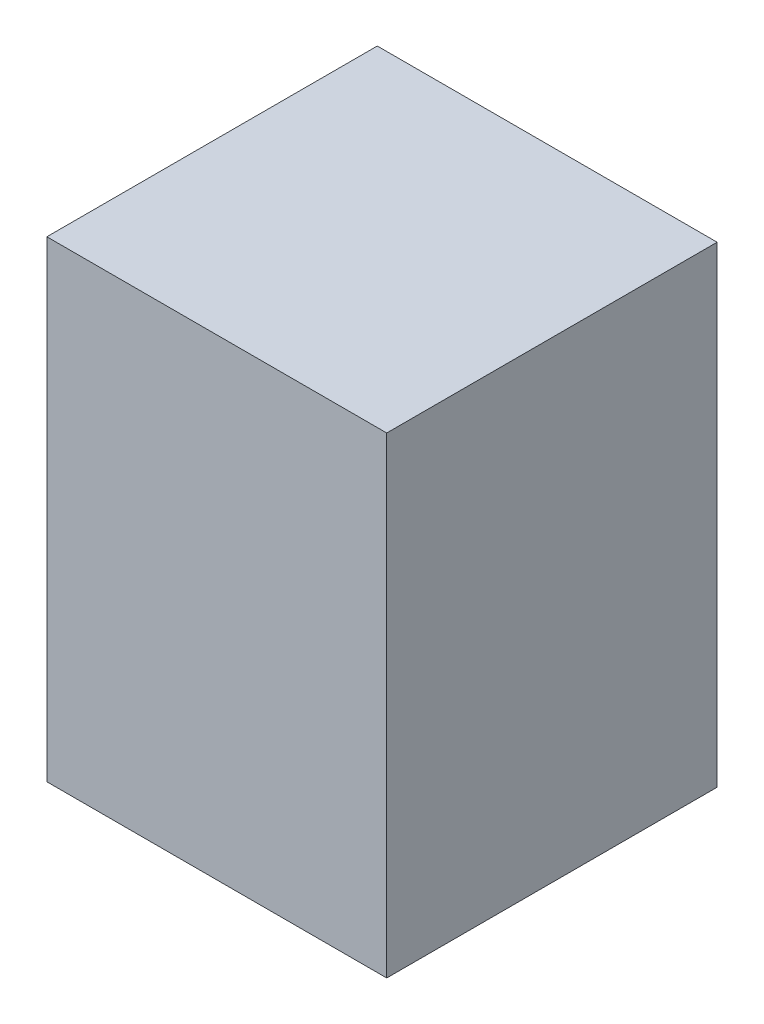
ISO-10303-21;
HEADER;
FILE_DESCRIPTION(('STEP AP214'),'2;1');
FILE_NAME('part.step','',(''),(''),'','','');
FILE_SCHEMA(('AUTOMOTIVE_DESIGN { 1 0 10303 214 1 1 1 1 }'));
ENDSEC;
DATA;
#1=APPLICATION_CONTEXT('core data for automotive mechanical design processes');
#2=APPLICATION_PROTOCOL_DEFINITION('international standard','automotive_design',2000,#1);
#3=PRODUCT_CONTEXT('',#1,'mechanical');
#4=PRODUCT('Part','Part','',(#3));
#5=PRODUCT_RELATED_PRODUCT_CATEGORY('part','',(#4));
#6=PRODUCT_DEFINITION_FORMATION('','',#4);
#7=PRODUCT_DEFINITION_CONTEXT('part definition',#1,'design');
#8=PRODUCT_DEFINITION('design','',#6,#7);
#9=PRODUCT_DEFINITION_SHAPE('','',#8);
#10=(LENGTH_UNIT() NAMED_UNIT(*) SI_UNIT(.MILLI.,.METRE.));
#11=(NAMED_UNIT(*) PLANE_ANGLE_UNIT() SI_UNIT($,.RADIAN.));
#12=(NAMED_UNIT(*) SI_UNIT($,.STERADIAN.) SOLID_ANGLE_UNIT());
#13=UNCERTAINTY_MEASURE_WITH_UNIT(LENGTH_MEASURE(1.E-05),#10,'distance_accuracy_value','');
#14=(GEOMETRIC_REPRESENTATION_CONTEXT(3) GLOBAL_UNCERTAINTY_ASSIGNED_CONTEXT((#13)) GLOBAL_UNIT_ASSIGNED_CONTEXT((#10,
#11,#12)) REPRESENTATION_CONTEXT('',''));
#15=CARTESIAN_POINT('',(0.,0.,0.));
#16=DIRECTION('',(0.,0.,1.));
#17=DIRECTION('',(1.,0.,0.));
#18=AXIS2_PLACEMENT_3D('',#15,#16,#17);
#19=CARTESIAN_POINT('',(0.,0.,70.));
#20=DIRECTION('',(1.,0.,0.));
#21=DIRECTION('',(0.,1.,0.));
#22=AXIS2_PLACEMENT_3D('',#19,#20,#21);
#23=PLANE('',#22);
#24=DIRECTION('',(0.,-1.,0.));
#25=VECTOR('',#24,1.);
#26=CARTESIAN_POINT('',(0.,0.,0.));
#27=LINE('',#26,#25);
#28=CARTESIAN_POINT('',(0.,100.,0.));
#29=VERTEX_POINT('',#28);
#30=CARTESIAN_POINT('',(0.,0.,0.));
#31=VERTEX_POINT('',#30);
#32=EDGE_CURVE('E100',#29,#31,#27,.T.);
#33=ORIENTED_EDGE('',*,*,#32,.T.);
#34=DIRECTION('',(0.,0.,-1.));
#35=VECTOR('',#34,1.);
#36=CARTESIAN_POINT('',(0.,0.,70.));
#37=LINE('',#36,#35);
#38=CARTESIAN_POINT('',(0.,0.,70.));
#39=VERTEX_POINT('',#38);
#40=EDGE_CURVE('E11',#39,#31,#37,.T.);
#41=ORIENTED_EDGE('',*,*,#40,.F.);
#42=DIRECTION('',(0.,-1.,0.));
#43=VECTOR('',#42,1.);
#44=CARTESIAN_POINT('',(0.,0.,70.));
#45=LINE('',#44,#43);
#46=CARTESIAN_POINT('',(0.,100.,70.));
#47=VERTEX_POINT('',#46);
#48=EDGE_CURVE('E88',#47,#39,#45,.T.);
#49=ORIENTED_EDGE('',*,*,#48,.F.);
#50=DIRECTION('',(0.,0.,-1.));
#51=VECTOR('',#50,1.);
#52=CARTESIAN_POINT('',(0.,100.,70.));
#53=LINE('',#52,#51);
#54=EDGE_CURVE('E96',#47,#29,#53,.T.);
#55=ORIENTED_EDGE('',*,*,#54,.T.);
#56=EDGE_LOOP('',(#33,#41,#49,#55));
#57=FACE_BOUND('',#56,.T.);
#58=ADVANCED_FACE('F37',(#57),#23,.F.);
#59=CARTESIAN_POINT('',(0.,0.,70.));
#60=DIRECTION('',(0.,1.,0.));
#61=DIRECTION('',(0.,0.,1.));
#62=AXIS2_PLACEMENT_3D('',#59,#60,#61);
#63=PLANE('',#62);
#64=CARTESIAN_POINT('',(40.,0.,20.));
#65=DIRECTION('',(0.,-1.,0.));
#66=DIRECTION('',(0.,0.,-1.));
#67=AXIS2_PLACEMENT_3D('',#64,#65,#66);
#68=CIRCLE('',#67,2.);
#69=CARTESIAN_POINT('',(40.,0.,18.));
#70=VERTEX_POINT('',#69);
#71=EDGE_CURVE('E120',#70,#70,#68,.T.);
#72=ORIENTED_EDGE('',*,*,#71,.F.);
#73=EDGE_LOOP('',(#72));
#74=FACE_BOUND('',#73,.T.);
#75=CARTESIAN_POINT('',(40.,0.,50.));
#76=DIRECTION('',(0.,-1.,0.));
#77=DIRECTION('',(0.,0.,-1.));
#78=AXIS2_PLACEMENT_3D('',#75,#76,#77);
#79=CIRCLE('',#78,2.);
#80=CARTESIAN_POINT('',(40.,0.,48.));
#81=VERTEX_POINT('',#80);
#82=EDGE_CURVE('E114',#81,#81,#79,.T.);
#83=ORIENTED_EDGE('',*,*,#82,.F.);
#84=EDGE_LOOP('',(#83));
#85=FACE_BOUND('',#84,.T.);
#86=DIRECTION('',(1.,0.,0.));
#87=VECTOR('',#86,1.);
#88=CARTESIAN_POINT('',(0.,0.,0.));
#89=LINE('',#88,#87);
#90=CARTESIAN_POINT('',(72.,0.,0.));
#91=VERTEX_POINT('',#90);
#92=EDGE_CURVE('E92',#31,#91,#89,.T.);
#93=ORIENTED_EDGE('',*,*,#92,.T.);
#94=DIRECTION('',(0.,0.,-1.));
#95=VECTOR('',#94,1.);
#96=CARTESIAN_POINT('',(72.,0.,70.));
#97=LINE('',#96,#95);
#98=CARTESIAN_POINT('',(72.,0.,70.));
#99=VERTEX_POINT('',#98);
#100=EDGE_CURVE('E45',#99,#91,#97,.T.);
#101=ORIENTED_EDGE('',*,*,#100,.F.);
#102=DIRECTION('',(1.,0.,0.));
#103=VECTOR('',#102,1.);
#104=CARTESIAN_POINT('',(0.,0.,70.));
#105=LINE('',#104,#103);
#106=EDGE_CURVE('E83',#39,#99,#105,.T.);
#107=ORIENTED_EDGE('',*,*,#106,.F.);
#108=ORIENTED_EDGE('',*,*,#40,.T.);
#109=EDGE_LOOP('',(#93,#101,#107,#108));
#110=FACE_BOUND('',#109,.T.);
#111=ADVANCED_FACE('F91',(#74,#85,#110),#63,.F.);
#112=CARTESIAN_POINT('',(72.,0.,70.));
#113=DIRECTION('',(-1.,0.,0.));
#114=DIRECTION('',(0.,-1.,0.));
#115=AXIS2_PLACEMENT_3D('',#112,#113,#114);
#116=PLANE('',#115);
#117=DIRECTION('',(0.,1.,0.));
#118=VECTOR('',#117,1.);
#119=CARTESIAN_POINT('',(72.,0.,0.));
#120=LINE('',#119,#118);
#121=CARTESIAN_POINT('',(72.,100.,0.));
#122=VERTEX_POINT('',#121);
#123=EDGE_CURVE('E70',#91,#122,#120,.T.);
#124=ORIENTED_EDGE('',*,*,#123,.T.);
#125=DIRECTION('',(0.,0.,-1.));
#126=VECTOR('',#125,1.);
#127=CARTESIAN_POINT('',(72.,100.,70.));
#128=LINE('',#127,#126);
#129=CARTESIAN_POINT('',(72.,100.,70.));
#130=VERTEX_POINT('',#129);
#131=EDGE_CURVE('E93',#130,#122,#128,.T.);
#132=ORIENTED_EDGE('',*,*,#131,.F.);
#133=DIRECTION('',(0.,1.,0.));
#134=VECTOR('',#133,1.);
#135=CARTESIAN_POINT('',(72.,0.,70.));
#136=LINE('',#135,#134);
#137=EDGE_CURVE('E86',#99,#130,#136,.T.);
#138=ORIENTED_EDGE('',*,*,#137,.F.);
#139=ORIENTED_EDGE('',*,*,#100,.T.);
#140=EDGE_LOOP('',(#124,#132,#138,#139));
#141=FACE_BOUND('',#140,.T.);
#142=ADVANCED_FACE('F94',(#141),#116,.F.);
#143=CARTESIAN_POINT('',(0.,100.,70.));
#144=DIRECTION('',(0.,-1.,0.));
#145=DIRECTION('',(0.,0.,-1.));
#146=AXIS2_PLACEMENT_3D('',#143,#144,#145);
#147=PLANE('',#146);
#148=DIRECTION('',(-1.,0.,0.));
#149=VECTOR('',#148,1.);
#150=CARTESIAN_POINT('',(0.,100.,0.));
#151=LINE('',#150,#149);
#152=EDGE_CURVE('E76',#122,#29,#151,.T.);
#153=ORIENTED_EDGE('',*,*,#152,.T.);
#154=ORIENTED_EDGE('',*,*,#54,.F.);
#155=DIRECTION('',(-1.,0.,0.));
#156=VECTOR('',#155,1.);
#157=CARTESIAN_POINT('',(0.,100.,70.));
#158=LINE('',#157,#156);
#159=EDGE_CURVE('E53',#130,#47,#158,.T.);
#160=ORIENTED_EDGE('',*,*,#159,.F.);
#161=ORIENTED_EDGE('',*,*,#131,.T.);
#162=EDGE_LOOP('',(#153,#154,#160,#161));
#163=FACE_BOUND('',#162,.T.);
#164=ADVANCED_FACE('F108',(#163),#147,.F.);
#165=CARTESIAN_POINT('',(0.,0.,70.));
#166=DIRECTION('',(0.,0.,-1.));
#167=DIRECTION('',(-1.,0.,0.));
#168=AXIS2_PLACEMENT_3D('',#165,#166,#167);
#169=PLANE('',#168);
#170=ORIENTED_EDGE('',*,*,#48,.T.);
#171=ORIENTED_EDGE('',*,*,#106,.T.);
#172=ORIENTED_EDGE('',*,*,#137,.T.);
#173=ORIENTED_EDGE('',*,*,#159,.T.);
#174=EDGE_LOOP('',(#170,#171,#172,#173));
#175=FACE_BOUND('',#174,.T.);
#176=ADVANCED_FACE('F84',(#175),#169,.F.);
#177=CARTESIAN_POINT('',(0.,0.,0.));
#178=DIRECTION('',(0.,0.,-1.));
#179=DIRECTION('',(-1.,0.,0.));
#180=AXIS2_PLACEMENT_3D('',#177,#178,#179);
#181=PLANE('',#180);
#182=ORIENTED_EDGE('',*,*,#32,.F.);
#183=ORIENTED_EDGE('',*,*,#152,.F.);
#184=ORIENTED_EDGE('',*,*,#123,.F.);
#185=ORIENTED_EDGE('',*,*,#92,.F.);
#186=EDGE_LOOP('',(#182,#183,#184,#185));
#187=FACE_BOUND('',#186,.T.);
#188=ADVANCED_FACE('F111',(#187),#181,.T.);
#189=CARTESIAN_POINT('',(40.,10.,50.));
#190=DIRECTION('',(0.,-1.,0.));
#191=DIRECTION('',(0.,0.,-1.));
#192=AXIS2_PLACEMENT_3D('',#189,#190,#191);
#193=CYLINDRICAL_SURFACE('',#192,2.);
#194=CARTESIAN_POINT('',(40.,10.,50.));
#195=DIRECTION('',(0.,-1.,0.));
#196=DIRECTION('',(0.,0.,-1.));
#197=AXIS2_PLACEMENT_3D('',#194,#195,#196);
#198=CIRCLE('',#197,2.);
#199=CARTESIAN_POINT('',(40.,10.,48.));
#200=VERTEX_POINT('',#199);
#201=EDGE_CURVE('E103',#200,#200,#198,.T.);
#202=ORIENTED_EDGE('',*,*,#201,.F.);
#203=EDGE_LOOP('',(#202));
#204=FACE_BOUND('',#203,.T.);
#205=ORIENTED_EDGE('',*,*,#82,.T.);
#206=EDGE_LOOP('',(#205));
#207=FACE_BOUND('',#206,.T.);
#208=ADVANCED_FACE('F139',(#204,#207),#193,.F.);
#209=CARTESIAN_POINT('',(40.,10.,50.));
#210=DIRECTION('',(0.,-1.,0.));
#211=DIRECTION('',(0.,0.,-1.));
#212=AXIS2_PLACEMENT_3D('',#209,#210,#211);
#213=PLANE('',#212);
#214=ORIENTED_EDGE('',*,*,#201,.T.);
#215=EDGE_LOOP('',(#214));
#216=FACE_BOUND('',#215,.T.);
#217=ADVANCED_FACE('F131',(#216),#213,.T.);
#218=CARTESIAN_POINT('',(40.,10.,20.));
#219=DIRECTION('',(0.,-1.,0.));
#220=DIRECTION('',(0.,0.,-1.));
#221=AXIS2_PLACEMENT_3D('',#218,#219,#220);
#222=CYLINDRICAL_SURFACE('',#221,2.);
#223=CARTESIAN_POINT('',(40.,10.,20.));
#224=DIRECTION('',(0.,-1.,0.));
#225=DIRECTION('',(0.,0.,-1.));
#226=AXIS2_PLACEMENT_3D('',#223,#224,#225);
#227=CIRCLE('',#226,2.);
#228=CARTESIAN_POINT('',(40.,10.,18.));
#229=VERTEX_POINT('',#228);
#230=EDGE_CURVE('E117',#229,#229,#227,.T.);
#231=ORIENTED_EDGE('',*,*,#230,.F.);
#232=EDGE_LOOP('',(#231));
#233=FACE_BOUND('',#232,.T.);
#234=ORIENTED_EDGE('',*,*,#71,.T.);
#235=EDGE_LOOP('',(#234));
#236=FACE_BOUND('',#235,.T.);
#237=ADVANCED_FACE('F128',(#233,#236),#222,.F.);
#238=CARTESIAN_POINT('',(40.,10.,20.));
#239=DIRECTION('',(0.,-1.,0.));
#240=DIRECTION('',(0.,0.,-1.));
#241=AXIS2_PLACEMENT_3D('',#238,#239,#240);
#242=PLANE('',#241);
#243=ORIENTED_EDGE('',*,*,#230,.T.);
#244=EDGE_LOOP('',(#243));
#245=FACE_BOUND('',#244,.T.);
#246=ADVANCED_FACE('F126',(#245),#242,.T.);
#247=CLOSED_SHELL('',(#58,#111,#142,#164,#176,#188,#208,#217,#237,#246));
#248=MANIFOLD_SOLID_BREP('B2',#247);
#249=ADVANCED_BREP_SHAPE_REPRESENTATION('',(#18,#248),#14);
#250=SHAPE_DEFINITION_REPRESENTATION(#9,#249);
ENDSEC;
END-ISO-10303-21;
